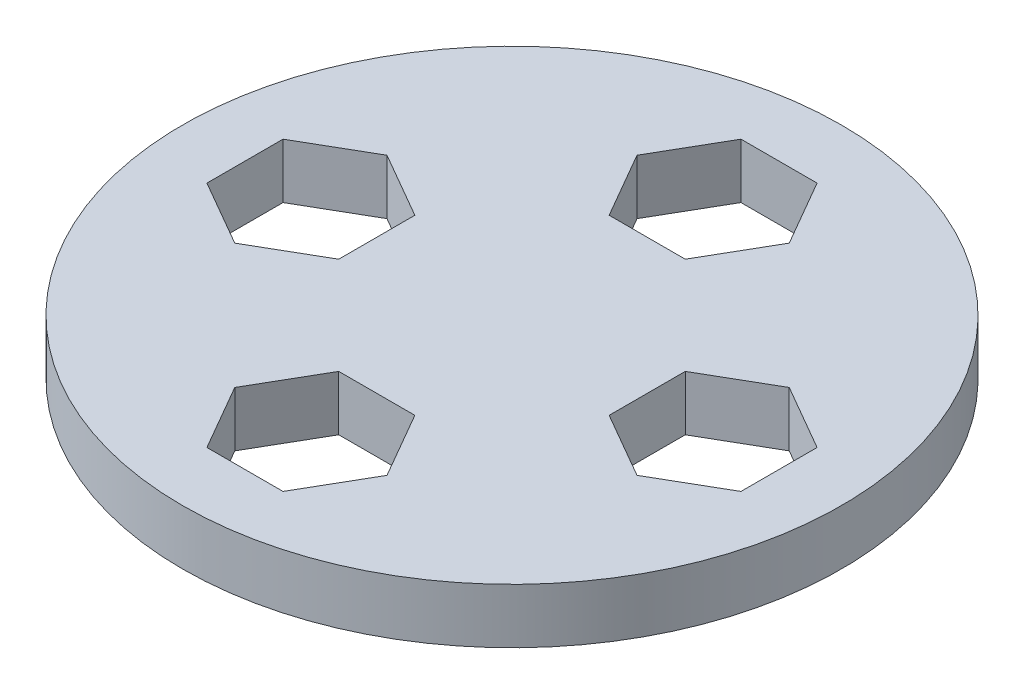
ISO-10303-21;
HEADER;
FILE_DESCRIPTION(('STEP AP214'),'2;1');
FILE_NAME('part.step','',(''),(''),'','','');
FILE_SCHEMA(('AUTOMOTIVE_DESIGN { 1 0 10303 214 1 1 1 1 }'));
ENDSEC;
DATA;
#1=APPLICATION_CONTEXT('core data for automotive mechanical design processes');
#2=APPLICATION_PROTOCOL_DEFINITION('international standard','automotive_design',2000,#1);
#3=PRODUCT_CONTEXT('',#1,'mechanical');
#4=PRODUCT('Part','Part','',(#3));
#5=PRODUCT_RELATED_PRODUCT_CATEGORY('part','',(#4));
#6=PRODUCT_DEFINITION_FORMATION('','',#4);
#7=PRODUCT_DEFINITION_CONTEXT('part definition',#1,'design');
#8=PRODUCT_DEFINITION('design','',#6,#7);
#9=PRODUCT_DEFINITION_SHAPE('','',#8);
#10=(LENGTH_UNIT() NAMED_UNIT(*) SI_UNIT(.MILLI.,.METRE.));
#11=(NAMED_UNIT(*) PLANE_ANGLE_UNIT() SI_UNIT($,.RADIAN.));
#12=(NAMED_UNIT(*) SI_UNIT($,.STERADIAN.) SOLID_ANGLE_UNIT());
#13=UNCERTAINTY_MEASURE_WITH_UNIT(LENGTH_MEASURE(1.E-05),#10,'distance_accuracy_value','');
#14=(GEOMETRIC_REPRESENTATION_CONTEXT(3) GLOBAL_UNCERTAINTY_ASSIGNED_CONTEXT((#13)) GLOBAL_UNIT_ASSIGNED_CONTEXT((#10,
#11,#12)) REPRESENTATION_CONTEXT('',''));
#15=CARTESIAN_POINT('',(0.,0.,0.));
#16=DIRECTION('',(0.,0.,1.));
#17=DIRECTION('',(1.,0.,0.));
#18=AXIS2_PLACEMENT_3D('',#15,#16,#17);
#19=CARTESIAN_POINT('',(0.,8.5,0.));
#20=DIRECTION('',(0.,-1.,0.));
#21=DIRECTION('',(0.,0.,-1.));
#22=AXIS2_PLACEMENT_3D('',#19,#20,#21);
#23=CYLINDRICAL_SURFACE('',#22,15.);
#24=CARTESIAN_POINT('',(0.,8.5,0.));
#25=DIRECTION('',(0.,1.,0.));
#26=DIRECTION('',(0.,0.,1.));
#27=AXIS2_PLACEMENT_3D('',#24,#25,#26);
#28=CIRCLE('',#27,15.);
#29=CARTESIAN_POINT('',(0.,8.5,15.));
#30=VERTEX_POINT('',#29);
#31=EDGE_CURVE('E372',#30,#30,#28,.T.);
#32=ORIENTED_EDGE('',*,*,#31,.F.);
#33=EDGE_LOOP('',(#32));
#34=FACE_BOUND('',#33,.T.);
#35=CARTESIAN_POINT('',(0.,6.,0.));
#36=DIRECTION('',(0.,1.,0.));
#37=DIRECTION('',(0.,0.,1.));
#38=AXIS2_PLACEMENT_3D('',#35,#36,#37);
#39=CIRCLE('',#38,15.);
#40=CARTESIAN_POINT('',(0.,6.,15.));
#41=VERTEX_POINT('',#40);
#42=EDGE_CURVE('E361',#41,#41,#39,.T.);
#43=ORIENTED_EDGE('',*,*,#42,.T.);
#44=EDGE_LOOP('',(#43));
#45=FACE_BOUND('',#44,.T.);
#46=ADVANCED_FACE('F33',(#34,#45),#23,.T.);
#47=CARTESIAN_POINT('',(0.,8.5,0.));
#48=DIRECTION('',(0.,1.,0.));
#49=DIRECTION('',(0.,0.,1.));
#50=AXIS2_PLACEMENT_3D('',#47,#48,#49);
#51=PLANE('',#50);
#52=DIRECTION('',(-0.866025403784444,0.,0.499999999999991));
#53=VECTOR('',#52,1.);
#54=CARTESIAN_POINT('',(-9.15400145941037,8.5,-3.46410161513785));
#55=LINE('',#54,#53);
#56=CARTESIAN_POINT('',(-9.15400145941037,8.5,-3.46410161513785));
#57=VERTEX_POINT('',#56);
#58=CARTESIAN_POINT('',(-12.1540014594104,8.5,-1.732050807569));
#59=VERTEX_POINT('',#58);
#60=EDGE_CURVE('E47',#57,#59,#55,.T.);
#61=ORIENTED_EDGE('',*,*,#60,.F.);
#62=DIRECTION('',(-0.866025403784433,0.,-0.500000000000009));
#63=VECTOR('',#62,1.);
#64=CARTESIAN_POINT('',(-6.15400145941038,8.5,-1.73205080756894));
#65=LINE('',#64,#63);
#66=CARTESIAN_POINT('',(-6.15400145941038,8.5,-1.73205080756894));
#67=VERTEX_POINT('',#66);
#68=EDGE_CURVE('E230',#67,#57,#65,.T.);
#69=ORIENTED_EDGE('',*,*,#68,.F.);
#70=DIRECTION('',(0.,0.,-1.));
#71=VECTOR('',#70,1.);
#72=CARTESIAN_POINT('',(-6.15400145941042,8.5,1.73205080756882));
#73=LINE('',#72,#71);
#74=CARTESIAN_POINT('',(-6.15400145941042,8.5,1.73205080756882));
#75=VERTEX_POINT('',#74);
#76=EDGE_CURVE('E228',#75,#67,#73,.T.);
#77=ORIENTED_EDGE('',*,*,#76,.F.);
#78=DIRECTION('',(0.866025403784444,0.,-0.499999999999991));
#79=VECTOR('',#78,1.);
#80=CARTESIAN_POINT('',(-9.15400145941044,8.5,3.46410161513766));
#81=LINE('',#80,#79);
#82=CARTESIAN_POINT('',(-9.15400145941044,8.5,3.46410161513766));
#83=VERTEX_POINT('',#82);
#84=EDGE_CURVE('E206',#83,#75,#81,.T.);
#85=ORIENTED_EDGE('',*,*,#84,.F.);
#86=DIRECTION('',(0.866025403784433,0.,0.500000000000009));
#87=VECTOR('',#86,1.);
#88=CARTESIAN_POINT('',(-12.1540014594104,8.5,1.73205080756875));
#89=LINE('',#88,#87);
#90=CARTESIAN_POINT('',(-12.1540014594104,8.5,1.73205080756875));
#91=VERTEX_POINT('',#90);
#92=EDGE_CURVE('E224',#91,#83,#89,.T.);
#93=ORIENTED_EDGE('',*,*,#92,.F.);
#94=DIRECTION('',(0.,0.,1.));
#95=VECTOR('',#94,1.);
#96=CARTESIAN_POINT('',(-12.1540014594104,8.5,-1.732050807569));
#97=LINE('',#96,#95);
#98=EDGE_CURVE('E221',#59,#91,#97,.T.);
#99=ORIENTED_EDGE('',*,*,#98,.F.);
#100=EDGE_LOOP('',(#61,#69,#77,#85,#93,#99));
#101=FACE_BOUND('',#100,.T.);
#102=DIRECTION('',(0.499999999999994,0.,0.866025403784442));
#103=VECTOR('',#102,1.);
#104=CARTESIAN_POINT('',(-3.46410161513782,8.5,9.15400145941038));
#105=LINE('',#104,#103);
#106=CARTESIAN_POINT('',(-3.46410161513782,8.5,9.15400145941038));
#107=VERTEX_POINT('',#106);
#108=CARTESIAN_POINT('',(-1.73205080756896,8.5,12.1540014594104));
#109=VERTEX_POINT('',#108);
#110=EDGE_CURVE('E236',#107,#109,#105,.T.);
#111=ORIENTED_EDGE('',*,*,#110,.F.);
#112=DIRECTION('',(-0.500000000000006,0.,0.866025403784435));
#113=VECTOR('',#112,1.);
#114=CARTESIAN_POINT('',(-1.73205080756892,8.5,6.15400145941039));
#115=LINE('',#114,#113);
#116=CARTESIAN_POINT('',(-1.73205080756892,8.5,6.15400145941039));
#117=VERTEX_POINT('',#116);
#118=EDGE_CURVE('E244',#117,#107,#115,.T.);
#119=ORIENTED_EDGE('',*,*,#118,.F.);
#120=DIRECTION('',(-1.,0.,0.));
#121=VECTOR('',#120,1.);
#122=CARTESIAN_POINT('',(1.73205080756884,8.5,6.15400145941042));
#123=LINE('',#122,#121);
#124=CARTESIAN_POINT('',(1.73205080756884,8.5,6.15400145941042));
#125=VERTEX_POINT('',#124);
#126=EDGE_CURVE('E266',#125,#117,#123,.T.);
#127=ORIENTED_EDGE('',*,*,#126,.F.);
#128=DIRECTION('',(-0.499999999999994,0.,-0.866025403784442));
#129=VECTOR('',#128,1.);
#130=CARTESIAN_POINT('',(3.46410161513769,8.5,9.15400145941043));
#131=LINE('',#130,#129);
#132=CARTESIAN_POINT('',(3.46410161513769,8.5,9.15400145941043));
#133=VERTEX_POINT('',#132);
#134=EDGE_CURVE('E263',#133,#125,#131,.T.);
#135=ORIENTED_EDGE('',*,*,#134,.F.);
#136=DIRECTION('',(0.500000000000006,0.,-0.866025403784435));
#137=VECTOR('',#136,1.);
#138=CARTESIAN_POINT('',(1.73205080756879,8.5,12.1540014594104));
#139=LINE('',#138,#137);
#140=CARTESIAN_POINT('',(1.73205080756879,8.5,12.1540014594104));
#141=VERTEX_POINT('',#140);
#142=EDGE_CURVE('E260',#141,#133,#139,.T.);
#143=ORIENTED_EDGE('',*,*,#142,.F.);
#144=DIRECTION('',(1.,0.,0.));
#145=VECTOR('',#144,1.);
#146=CARTESIAN_POINT('',(-1.73205080756896,8.5,12.1540014594104));
#147=LINE('',#146,#145);
#148=EDGE_CURVE('E257',#109,#141,#147,.T.);
#149=ORIENTED_EDGE('',*,*,#148,.F.);
#150=EDGE_LOOP('',(#111,#119,#127,#135,#143,#149));
#151=FACE_BOUND('',#150,.T.);
#152=DIRECTION('',(0.86602540378444,0.,-0.499999999999997));
#153=VECTOR('',#152,1.);
#154=CARTESIAN_POINT('',(9.15400145941039,8.5,3.46410161513778));
#155=LINE('',#154,#153);
#156=CARTESIAN_POINT('',(9.15400145941039,8.5,3.46410161513778));
#157=VERTEX_POINT('',#156);
#158=CARTESIAN_POINT('',(12.1540014594104,8.5,1.73205080756892));
#159=VERTEX_POINT('',#158);
#160=EDGE_CURVE('E273',#157,#159,#155,.T.);
#161=ORIENTED_EDGE('',*,*,#160,.F.);
#162=DIRECTION('',(0.866025403784437,0.,0.500000000000003));
#163=VECTOR('',#162,1.);
#164=CARTESIAN_POINT('',(6.1540014594104,8.5,1.7320508075689));
#165=LINE('',#164,#163);
#166=CARTESIAN_POINT('',(6.1540014594104,8.5,1.7320508075689));
#167=VERTEX_POINT('',#166);
#168=EDGE_CURVE('E288',#167,#157,#165,.T.);
#169=ORIENTED_EDGE('',*,*,#168,.F.);
#170=DIRECTION('',(0.,0.,1.));
#171=VECTOR('',#170,1.);
#172=CARTESIAN_POINT('',(6.15400145941041,8.5,-1.73205080756886));
#173=LINE('',#172,#171);
#174=CARTESIAN_POINT('',(6.15400145941041,8.5,-1.73205080756886));
#175=VERTEX_POINT('',#174);
#176=EDGE_CURVE('E310',#175,#167,#173,.T.);
#177=ORIENTED_EDGE('',*,*,#176,.F.);
#178=DIRECTION('',(-0.86602540378444,0.,0.499999999999997));
#179=VECTOR('',#178,1.);
#180=CARTESIAN_POINT('',(9.15400145941041,8.5,-3.46410161513773));
#181=LINE('',#180,#179);
#182=CARTESIAN_POINT('',(9.15400145941041,8.5,-3.46410161513773));
#183=VERTEX_POINT('',#182);
#184=EDGE_CURVE('E307',#183,#175,#181,.T.);
#185=ORIENTED_EDGE('',*,*,#184,.F.);
#186=DIRECTION('',(-0.866025403784437,0.,-0.500000000000003));
#187=VECTOR('',#186,1.);
#188=CARTESIAN_POINT('',(12.1540014594104,8.5,-1.73205080756884));
#189=LINE('',#188,#187);
#190=CARTESIAN_POINT('',(12.1540014594104,8.5,-1.73205080756884));
#191=VERTEX_POINT('',#190);
#192=EDGE_CURVE('E304',#191,#183,#189,.T.);
#193=ORIENTED_EDGE('',*,*,#192,.F.);
#194=DIRECTION('',(0.,0.,-1.));
#195=VECTOR('',#194,1.);
#196=CARTESIAN_POINT('',(12.1540014594104,8.5,1.73205080756892));
#197=LINE('',#196,#195);
#198=EDGE_CURVE('E301',#159,#191,#197,.T.);
#199=ORIENTED_EDGE('',*,*,#198,.F.);
#200=EDGE_LOOP('',(#161,#169,#177,#185,#193,#199));
#201=FACE_BOUND('',#200,.T.);
#202=DIRECTION('',(0.5,0.,-0.866025403784438));
#203=VECTOR('',#202,1.);
#204=CARTESIAN_POINT('',(1.73205080756888,8.5,-6.1540014594104));
#205=LINE('',#204,#203);
#206=CARTESIAN_POINT('',(1.73205080756888,8.5,-6.1540014594104));
#207=VERTEX_POINT('',#206);
#208=CARTESIAN_POINT('',(3.46410161513775,8.5,-9.1540014594104));
#209=VERTEX_POINT('',#208);
#210=EDGE_CURVE('E317',#207,#209,#205,.T.);
#211=ORIENTED_EDGE('',*,*,#210,.F.);
#212=DIRECTION('',(1.,0.,0.));
#213=VECTOR('',#212,1.);
#214=CARTESIAN_POINT('',(-1.73205080756888,8.5,-6.1540014594104));
#215=LINE('',#214,#213);
#216=CARTESIAN_POINT('',(-1.73205080756888,8.5,-6.1540014594104));
#217=VERTEX_POINT('',#216);
#218=EDGE_CURVE('E332',#217,#207,#215,.T.);
#219=ORIENTED_EDGE('',*,*,#218,.F.);
#220=DIRECTION('',(0.5,0.,0.866025403784439));
#221=VECTOR('',#220,1.);
#222=CARTESIAN_POINT('',(-3.46410161513776,8.5,-9.1540014594104));
#223=LINE('',#222,#221);
#224=CARTESIAN_POINT('',(-3.46410161513776,8.5,-9.1540014594104));
#225=VERTEX_POINT('',#224);
#226=EDGE_CURVE('E354',#225,#217,#223,.T.);
#227=ORIENTED_EDGE('',*,*,#226,.F.);
#228=DIRECTION('',(-0.5,0.,0.866025403784439));
#229=VECTOR('',#228,1.);
#230=CARTESIAN_POINT('',(-1.73205080756888,8.5,-12.1540014594104));
#231=LINE('',#230,#229);
#232=CARTESIAN_POINT('',(-1.73205080756888,8.5,-12.1540014594104));
#233=VERTEX_POINT('',#232);
#234=EDGE_CURVE('E351',#233,#225,#231,.T.);
#235=ORIENTED_EDGE('',*,*,#234,.F.);
#236=DIRECTION('',(-1.,0.,0.));
#237=VECTOR('',#236,1.);
#238=CARTESIAN_POINT('',(1.73205080756888,8.5,-12.1540014594104));
#239=LINE('',#238,#237);
#240=CARTESIAN_POINT('',(1.73205080756888,8.5,-12.1540014594104));
#241=VERTEX_POINT('',#240);
#242=EDGE_CURVE('E348',#241,#233,#239,.T.);
#243=ORIENTED_EDGE('',*,*,#242,.F.);
#244=DIRECTION('',(-0.5,0.,-0.866025403784439));
#245=VECTOR('',#244,1.);
#246=CARTESIAN_POINT('',(3.46410161513775,8.5,-9.1540014594104));
#247=LINE('',#246,#245);
#248=EDGE_CURVE('E345',#209,#241,#247,.T.);
#249=ORIENTED_EDGE('',*,*,#248,.F.);
#250=EDGE_LOOP('',(#211,#219,#227,#235,#243,#249));
#251=FACE_BOUND('',#250,.T.);
#252=ORIENTED_EDGE('',*,*,#31,.T.);
#253=EDGE_LOOP('',(#252));
#254=FACE_BOUND('',#253,.T.);
#255=ADVANCED_FACE('F408',(#101,#151,#201,#251,#254),#51,.T.);
#256=CARTESIAN_POINT('',(0.,6.,0.));
#257=DIRECTION('',(0.,1.,0.));
#258=DIRECTION('',(0.,0.,1.));
#259=AXIS2_PLACEMENT_3D('',#256,#257,#258);
#260=PLANE('',#259);
#261=DIRECTION('',(1.,0.,0.));
#262=VECTOR('',#261,1.);
#263=CARTESIAN_POINT('',(-1.73205080756888,6.,-6.1540014594104));
#264=LINE('',#263,#262);
#265=CARTESIAN_POINT('',(-1.73205080756888,6.,-6.1540014594104));
#266=VERTEX_POINT('',#265);
#267=CARTESIAN_POINT('',(1.73205080756888,6.,-6.1540014594104));
#268=VERTEX_POINT('',#267);
#269=EDGE_CURVE('E340',#266,#268,#264,.T.);
#270=ORIENTED_EDGE('',*,*,#269,.T.);
#271=DIRECTION('',(0.5,0.,-0.866025403784439));
#272=VECTOR('',#271,1.);
#273=CARTESIAN_POINT('',(-1.3657226937113,6.,-0.788500364852602));
#274=LINE('',#273,#272);
#275=CARTESIAN_POINT('',(3.46410161513775,6.,-9.1540014594104));
#276=VERTEX_POINT('',#275);
#277=EDGE_CURVE('E375',#268,#276,#274,.T.);
#278=ORIENTED_EDGE('',*,*,#277,.T.);
#279=DIRECTION('',(-0.5,0.,-0.866025403784439));
#280=VECTOR('',#279,1.);
#281=CARTESIAN_POINT('',(3.46410161513775,6.,-9.1540014594104));
#282=LINE('',#281,#280);
#283=CARTESIAN_POINT('',(1.73205080756888,6.,-12.1540014594104));
#284=VERTEX_POINT('',#283);
#285=EDGE_CURVE('E328',#276,#284,#282,.T.);
#286=ORIENTED_EDGE('',*,*,#285,.T.);
#287=DIRECTION('',(-1.,0.,0.));
#288=VECTOR('',#287,1.);
#289=CARTESIAN_POINT('',(1.73205080756888,6.,-12.1540014594104));
#290=LINE('',#289,#288);
#291=CARTESIAN_POINT('',(-1.73205080756888,6.,-12.1540014594104));
#292=VERTEX_POINT('',#291);
#293=EDGE_CURVE('E331',#284,#292,#290,.T.);
#294=ORIENTED_EDGE('',*,*,#293,.T.);
#295=DIRECTION('',(-0.5,0.,0.866025403784439));
#296=VECTOR('',#295,1.);
#297=CARTESIAN_POINT('',(-1.73205080756888,6.,-12.1540014594104));
#298=LINE('',#297,#296);
#299=CARTESIAN_POINT('',(-3.46410161513776,6.,-9.1540014594104));
#300=VERTEX_POINT('',#299);
#301=EDGE_CURVE('E335',#292,#300,#298,.T.);
#302=ORIENTED_EDGE('',*,*,#301,.T.);
#303=DIRECTION('',(0.5,0.,0.866025403784439));
#304=VECTOR('',#303,1.);
#305=CARTESIAN_POINT('',(-3.46410161513776,6.,-9.1540014594104));
#306=LINE('',#305,#304);
#307=EDGE_CURVE('E338',#300,#266,#306,.T.);
#308=ORIENTED_EDGE('',*,*,#307,.T.);
#309=EDGE_LOOP('',(#270,#278,#286,#294,#302,#308));
#310=FACE_BOUND('',#309,.T.);
#311=DIRECTION('',(0.,0.,1.));
#312=VECTOR('',#311,1.);
#313=CARTESIAN_POINT('',(6.15400145941041,6.,-1.73205080756886));
#314=LINE('',#313,#312);
#315=CARTESIAN_POINT('',(6.15400145941041,6.,-1.73205080756886));
#316=VERTEX_POINT('',#315);
#317=CARTESIAN_POINT('',(6.1540014594104,6.,1.7320508075689));
#318=VERTEX_POINT('',#317);
#319=EDGE_CURVE('E296',#316,#318,#314,.T.);
#320=ORIENTED_EDGE('',*,*,#319,.T.);
#321=DIRECTION('',(0.866025403784437,0.,0.500000000000003));
#322=VECTOR('',#321,1.);
#323=CARTESIAN_POINT('',(0.788500364852608,6.,-1.3657226937113));
#324=LINE('',#323,#322);
#325=CARTESIAN_POINT('',(9.15400145941039,6.,3.46410161513778));
#326=VERTEX_POINT('',#325);
#327=EDGE_CURVE('E379',#318,#326,#324,.T.);
#328=ORIENTED_EDGE('',*,*,#327,.T.);
#329=DIRECTION('',(0.86602540378444,0.,-0.499999999999997));
#330=VECTOR('',#329,1.);
#331=CARTESIAN_POINT('',(9.15400145941039,6.,3.46410161513778));
#332=LINE('',#331,#330);
#333=CARTESIAN_POINT('',(12.1540014594104,6.,1.73205080756892));
#334=VERTEX_POINT('',#333);
#335=EDGE_CURVE('E284',#326,#334,#332,.T.);
#336=ORIENTED_EDGE('',*,*,#335,.T.);
#337=DIRECTION('',(0.,0.,-1.));
#338=VECTOR('',#337,1.);
#339=CARTESIAN_POINT('',(12.1540014594104,6.,1.73205080756892));
#340=LINE('',#339,#338);
#341=CARTESIAN_POINT('',(12.1540014594104,6.,-1.73205080756884));
#342=VERTEX_POINT('',#341);
#343=EDGE_CURVE('E287',#334,#342,#340,.T.);
#344=ORIENTED_EDGE('',*,*,#343,.T.);
#345=DIRECTION('',(-0.866025403784437,0.,-0.500000000000003));
#346=VECTOR('',#345,1.);
#347=CARTESIAN_POINT('',(12.1540014594104,6.,-1.73205080756884));
#348=LINE('',#347,#346);
#349=CARTESIAN_POINT('',(9.15400145941041,6.,-3.46410161513773));
#350=VERTEX_POINT('',#349);
#351=EDGE_CURVE('E291',#342,#350,#348,.T.);
#352=ORIENTED_EDGE('',*,*,#351,.T.);
#353=DIRECTION('',(-0.86602540378444,0.,0.499999999999997));
#354=VECTOR('',#353,1.);
#355=CARTESIAN_POINT('',(9.15400145941041,6.,-3.46410161513773));
#356=LINE('',#355,#354);
#357=EDGE_CURVE('E294',#350,#316,#356,.T.);
#358=ORIENTED_EDGE('',*,*,#357,.T.);
#359=EDGE_LOOP('',(#320,#328,#336,#344,#352,#358));
#360=FACE_BOUND('',#359,.T.);
#361=DIRECTION('',(-1.,0.,0.));
#362=VECTOR('',#361,1.);
#363=CARTESIAN_POINT('',(1.73205080756884,6.,6.15400145941042));
#364=LINE('',#363,#362);
#365=CARTESIAN_POINT('',(1.73205080756884,6.,6.15400145941042));
#366=VERTEX_POINT('',#365);
#367=CARTESIAN_POINT('',(-1.73205080756892,6.,6.15400145941039));
#368=VERTEX_POINT('',#367);
#369=EDGE_CURVE('E252',#366,#368,#364,.T.);
#370=ORIENTED_EDGE('',*,*,#369,.T.);
#371=DIRECTION('',(-0.500000000000006,0.,0.866025403784435));
#372=VECTOR('',#371,1.);
#373=CARTESIAN_POINT('',(1.3657226937113,6.,0.788500364852611));
#374=LINE('',#373,#372);
#375=CARTESIAN_POINT('',(-3.46410161513782,6.,9.15400145941038));
#376=VERTEX_POINT('',#375);
#377=EDGE_CURVE('E40',#368,#376,#374,.T.);
#378=ORIENTED_EDGE('',*,*,#377,.T.);
#379=DIRECTION('',(0.499999999999994,0.,0.866025403784442));
#380=VECTOR('',#379,1.);
#381=CARTESIAN_POINT('',(-3.46410161513782,6.,9.15400145941038));
#382=LINE('',#381,#380);
#383=CARTESIAN_POINT('',(-1.73205080756896,6.,12.1540014594104));
#384=VERTEX_POINT('',#383);
#385=EDGE_CURVE('E240',#376,#384,#382,.T.);
#386=ORIENTED_EDGE('',*,*,#385,.T.);
#387=DIRECTION('',(1.,0.,0.));
#388=VECTOR('',#387,1.);
#389=CARTESIAN_POINT('',(-1.73205080756896,6.,12.1540014594104));
#390=LINE('',#389,#388);
#391=CARTESIAN_POINT('',(1.73205080756879,6.,12.1540014594104));
#392=VERTEX_POINT('',#391);
#393=EDGE_CURVE('E243',#384,#392,#390,.T.);
#394=ORIENTED_EDGE('',*,*,#393,.T.);
#395=DIRECTION('',(0.500000000000006,0.,-0.866025403784435));
#396=VECTOR('',#395,1.);
#397=CARTESIAN_POINT('',(1.73205080756879,6.,12.1540014594104));
#398=LINE('',#397,#396);
#399=CARTESIAN_POINT('',(3.46410161513769,6.,9.15400145941043));
#400=VERTEX_POINT('',#399);
#401=EDGE_CURVE('E247',#392,#400,#398,.T.);
#402=ORIENTED_EDGE('',*,*,#401,.T.);
#403=DIRECTION('',(-0.499999999999994,0.,-0.866025403784442));
#404=VECTOR('',#403,1.);
#405=CARTESIAN_POINT('',(3.46410161513769,6.,9.15400145941043));
#406=LINE('',#405,#404);
#407=EDGE_CURVE('E250',#400,#366,#406,.T.);
#408=ORIENTED_EDGE('',*,*,#407,.T.);
#409=EDGE_LOOP('',(#370,#378,#386,#394,#402,#408));
#410=FACE_BOUND('',#409,.T.);
#411=DIRECTION('',(0.866025403784444,0.,-0.499999999999991));
#412=VECTOR('',#411,1.);
#413=CARTESIAN_POINT('',(-9.15400145941044,6.,3.46410161513766));
#414=LINE('',#413,#412);
#415=CARTESIAN_POINT('',(-9.15400145941044,6.,3.46410161513766));
#416=VERTEX_POINT('',#415);
#417=CARTESIAN_POINT('',(-6.15400145941042,6.,1.73205080756882));
#418=VERTEX_POINT('',#417);
#419=EDGE_CURVE('E192',#416,#418,#414,.T.);
#420=ORIENTED_EDGE('',*,*,#419,.T.);
#421=DIRECTION('',(0.,0.,-1.));
#422=VECTOR('',#421,1.);
#423=CARTESIAN_POINT('',(-6.15400145941042,6.,1.73205080756882));
#424=LINE('',#423,#422);
#425=CARTESIAN_POINT('',(-6.15400145941038,6.,-1.73205080756894));
#426=VERTEX_POINT('',#425);
#427=EDGE_CURVE('E197',#418,#426,#424,.T.);
#428=ORIENTED_EDGE('',*,*,#427,.T.);
#429=DIRECTION('',(-0.866025403784433,0.,-0.500000000000009));
#430=VECTOR('',#429,1.);
#431=CARTESIAN_POINT('',(-0.788500364852616,6.,1.36572269371129));
#432=LINE('',#431,#430);
#433=CARTESIAN_POINT('',(-9.15400145941037,6.,-3.46410161513785));
#434=VERTEX_POINT('',#433);
#435=EDGE_CURVE('E11',#426,#434,#432,.T.);
#436=ORIENTED_EDGE('',*,*,#435,.T.);
#437=DIRECTION('',(-0.866025403784444,0.,0.499999999999991));
#438=VECTOR('',#437,1.);
#439=CARTESIAN_POINT('',(-9.15400145941037,6.,-3.46410161513785));
#440=LINE('',#439,#438);
#441=CARTESIAN_POINT('',(-12.1540014594104,6.,-1.732050807569));
#442=VERTEX_POINT('',#441);
#443=EDGE_CURVE('E233',#434,#442,#440,.T.);
#444=ORIENTED_EDGE('',*,*,#443,.T.);
#445=DIRECTION('',(0.,0.,1.));
#446=VECTOR('',#445,1.);
#447=CARTESIAN_POINT('',(-12.1540014594104,6.,-1.732050807569));
#448=LINE('',#447,#446);
#449=CARTESIAN_POINT('',(-12.1540014594104,6.,1.73205080756875));
#450=VERTEX_POINT('',#449);
#451=EDGE_CURVE('E517',#442,#450,#448,.T.);
#452=ORIENTED_EDGE('',*,*,#451,.T.);
#453=DIRECTION('',(0.866025403784433,0.,0.500000000000009));
#454=VECTOR('',#453,1.);
#455=CARTESIAN_POINT('',(-12.1540014594104,6.,1.73205080756875));
#456=LINE('',#455,#454);
#457=EDGE_CURVE('E55',#450,#416,#456,.T.);
#458=ORIENTED_EDGE('',*,*,#457,.T.);
#459=EDGE_LOOP('',(#420,#428,#436,#444,#452,#458));
#460=FACE_BOUND('',#459,.T.);
#461=ORIENTED_EDGE('',*,*,#42,.F.);
#462=EDGE_LOOP('',(#461));
#463=FACE_BOUND('',#462,.T.);
#464=ADVANCED_FACE('F194',(#310,#360,#410,#460,#463),#260,.F.);
#465=CARTESIAN_POINT('',(1.73205080756888,6.,-6.1540014594104));
#466=DIRECTION('',(0.866025403784439,0.,0.5));
#467=DIRECTION('',(0.5,0.,-0.866025403784439));
#468=AXIS2_PLACEMENT_3D('',#465,#466,#467);
#469=PLANE('',#468);
#470=ORIENTED_EDGE('',*,*,#210,.T.);
#471=DIRECTION('',(0.,1.,0.));
#472=VECTOR('',#471,1.);
#473=CARTESIAN_POINT('',(3.46410161513775,6.,-9.1540014594104));
#474=LINE('',#473,#472);
#475=EDGE_CURVE('E343',#276,#209,#474,.T.);
#476=ORIENTED_EDGE('',*,*,#475,.F.);
#477=ORIENTED_EDGE('',*,*,#277,.F.);
#478=DIRECTION('',(0.,1.,0.));
#479=VECTOR('',#478,1.);
#480=CARTESIAN_POINT('',(1.73205080756888,6.,-6.1540014594104));
#481=LINE('',#480,#479);
#482=EDGE_CURVE('E359',#268,#207,#481,.T.);
#483=ORIENTED_EDGE('',*,*,#482,.T.);
#484=EDGE_LOOP('',(#470,#476,#477,#483));
#485=FACE_BOUND('',#484,.T.);
#486=ADVANCED_FACE('F427',(#485),#469,.F.);
#487=CARTESIAN_POINT('',(-1.73205080756888,6.,-6.1540014594104));
#488=DIRECTION('',(0.,0.,1.));
#489=DIRECTION('',(1.,0.,0.));
#490=AXIS2_PLACEMENT_3D('',#487,#488,#489);
#491=PLANE('',#490);
#492=ORIENTED_EDGE('',*,*,#218,.T.);
#493=ORIENTED_EDGE('',*,*,#482,.F.);
#494=ORIENTED_EDGE('',*,*,#269,.F.);
#495=DIRECTION('',(0.,1.,0.));
#496=VECTOR('',#495,1.);
#497=CARTESIAN_POINT('',(-1.73205080756888,6.,-6.1540014594104));
#498=LINE('',#497,#496);
#499=EDGE_CURVE('E362',#266,#217,#498,.T.);
#500=ORIENTED_EDGE('',*,*,#499,.T.);
#501=EDGE_LOOP('',(#492,#493,#494,#500));
#502=FACE_BOUND('',#501,.T.);
#503=ADVANCED_FACE('F433',(#502),#491,.F.);
#504=CARTESIAN_POINT('',(-3.46410161513776,6.,-9.1540014594104));
#505=DIRECTION('',(-0.866025403784439,0.,0.5));
#506=DIRECTION('',(0.5,0.,0.866025403784439));
#507=AXIS2_PLACEMENT_3D('',#504,#505,#506);
#508=PLANE('',#507);
#509=ORIENTED_EDGE('',*,*,#226,.T.);
#510=ORIENTED_EDGE('',*,*,#499,.F.);
#511=ORIENTED_EDGE('',*,*,#307,.F.);
#512=DIRECTION('',(0.,1.,0.));
#513=VECTOR('',#512,1.);
#514=CARTESIAN_POINT('',(-3.46410161513776,6.,-9.1540014594104));
#515=LINE('',#514,#513);
#516=EDGE_CURVE('E364',#300,#225,#515,.T.);
#517=ORIENTED_EDGE('',*,*,#516,.T.);
#518=EDGE_LOOP('',(#509,#510,#511,#517));
#519=FACE_BOUND('',#518,.T.);
#520=ADVANCED_FACE('F450',(#519),#508,.F.);
#521=CARTESIAN_POINT('',(-1.73205080756888,6.,-12.1540014594104));
#522=DIRECTION('',(-0.866025403784439,0.,-0.5));
#523=DIRECTION('',(-0.5,0.,0.866025403784439));
#524=AXIS2_PLACEMENT_3D('',#521,#522,#523);
#525=PLANE('',#524);
#526=ORIENTED_EDGE('',*,*,#234,.T.);
#527=ORIENTED_EDGE('',*,*,#516,.F.);
#528=ORIENTED_EDGE('',*,*,#301,.F.);
#529=DIRECTION('',(0.,1.,0.));
#530=VECTOR('',#529,1.);
#531=CARTESIAN_POINT('',(-1.73205080756888,6.,-12.1540014594104));
#532=LINE('',#531,#530);
#533=EDGE_CURVE('E366',#292,#233,#532,.T.);
#534=ORIENTED_EDGE('',*,*,#533,.T.);
#535=EDGE_LOOP('',(#526,#527,#528,#534));
#536=FACE_BOUND('',#535,.T.);
#537=ADVANCED_FACE('F446',(#536),#525,.F.);
#538=CARTESIAN_POINT('',(1.73205080756888,6.,-12.1540014594104));
#539=DIRECTION('',(0.,0.,-1.));
#540=DIRECTION('',(-1.,0.,0.));
#541=AXIS2_PLACEMENT_3D('',#538,#539,#540);
#542=PLANE('',#541);
#543=ORIENTED_EDGE('',*,*,#242,.T.);
#544=ORIENTED_EDGE('',*,*,#533,.F.);
#545=ORIENTED_EDGE('',*,*,#293,.F.);
#546=DIRECTION('',(0.,1.,0.));
#547=VECTOR('',#546,1.);
#548=CARTESIAN_POINT('',(1.73205080756888,6.,-12.1540014594104));
#549=LINE('',#548,#547);
#550=EDGE_CURVE('E368',#284,#241,#549,.T.);
#551=ORIENTED_EDGE('',*,*,#550,.T.);
#552=EDGE_LOOP('',(#543,#544,#545,#551));
#553=FACE_BOUND('',#552,.T.);
#554=ADVANCED_FACE('F442',(#553),#542,.F.);
#555=CARTESIAN_POINT('',(3.46410161513775,6.,-9.1540014594104));
#556=DIRECTION('',(0.866025403784439,0.,-0.5));
#557=DIRECTION('',(-0.5,0.,-0.866025403784439));
#558=AXIS2_PLACEMENT_3D('',#555,#556,#557);
#559=PLANE('',#558);
#560=ORIENTED_EDGE('',*,*,#248,.T.);
#561=ORIENTED_EDGE('',*,*,#550,.F.);
#562=ORIENTED_EDGE('',*,*,#285,.F.);
#563=ORIENTED_EDGE('',*,*,#475,.T.);
#564=EDGE_LOOP('',(#560,#561,#562,#563));
#565=FACE_BOUND('',#564,.T.);
#566=ADVANCED_FACE('F438',(#565),#559,.F.);
#567=CARTESIAN_POINT('',(9.15400145941039,6.,3.46410161513778));
#568=DIRECTION('',(0.499999999999997,0.,0.866025403784441));
#569=DIRECTION('',(0.866025403784441,0.,-0.499999999999997));
#570=AXIS2_PLACEMENT_3D('',#567,#568,#569);
#571=PLANE('',#570);
#572=ORIENTED_EDGE('',*,*,#160,.T.);
#573=DIRECTION('',(0.,1.,0.));
#574=VECTOR('',#573,1.);
#575=CARTESIAN_POINT('',(12.1540014594104,6.,1.73205080756892));
#576=LINE('',#575,#574);
#577=EDGE_CURVE('E299',#334,#159,#576,.T.);
#578=ORIENTED_EDGE('',*,*,#577,.F.);
#579=ORIENTED_EDGE('',*,*,#335,.F.);
#580=DIRECTION('',(0.,1.,0.));
#581=VECTOR('',#580,1.);
#582=CARTESIAN_POINT('',(9.15400145941039,6.,3.46410161513778));
#583=LINE('',#582,#581);
#584=EDGE_CURVE('E315',#326,#157,#583,.T.);
#585=ORIENTED_EDGE('',*,*,#584,.T.);
#586=EDGE_LOOP('',(#572,#578,#579,#585));
#587=FACE_BOUND('',#586,.T.);
#588=ADVANCED_FACE('F441',(#587),#571,.F.);
#589=CARTESIAN_POINT('',(6.1540014594104,6.,1.7320508075689));
#590=DIRECTION('',(-0.500000000000003,0.,0.866025403784437));
#591=DIRECTION('',(0.866025403784437,0.,0.500000000000003));
#592=AXIS2_PLACEMENT_3D('',#589,#590,#591);
#593=PLANE('',#592);
#594=ORIENTED_EDGE('',*,*,#168,.T.);
#595=ORIENTED_EDGE('',*,*,#584,.F.);
#596=ORIENTED_EDGE('',*,*,#327,.F.);
#597=DIRECTION('',(0.,1.,0.));
#598=VECTOR('',#597,1.);
#599=CARTESIAN_POINT('',(6.1540014594104,6.,1.7320508075689));
#600=LINE('',#599,#598);
#601=EDGE_CURVE('E318',#318,#167,#600,.T.);
#602=ORIENTED_EDGE('',*,*,#601,.T.);
#603=EDGE_LOOP('',(#594,#595,#596,#602));
#604=FACE_BOUND('',#603,.T.);
#605=ADVANCED_FACE('F460',(#604),#593,.F.);
#606=CARTESIAN_POINT('',(6.15400145941041,6.,-1.73205080756886));
#607=DIRECTION('',(-1.,0.,0.));
#608=DIRECTION('',(0.,0.,1.));
#609=AXIS2_PLACEMENT_3D('',#606,#607,#608);
#610=PLANE('',#609);
#611=ORIENTED_EDGE('',*,*,#176,.T.);
#612=ORIENTED_EDGE('',*,*,#601,.F.);
#613=ORIENTED_EDGE('',*,*,#319,.F.);
#614=DIRECTION('',(0.,1.,0.));
#615=VECTOR('',#614,1.);
#616=CARTESIAN_POINT('',(6.15400145941041,6.,-1.73205080756886));
#617=LINE('',#616,#615);
#618=EDGE_CURVE('E320',#316,#175,#617,.T.);
#619=ORIENTED_EDGE('',*,*,#618,.T.);
#620=EDGE_LOOP('',(#611,#612,#613,#619));
#621=FACE_BOUND('',#620,.T.);
#622=ADVANCED_FACE('F473',(#621),#610,.F.);
#623=CARTESIAN_POINT('',(9.15400145941041,6.,-3.46410161513773));
#624=DIRECTION('',(-0.499999999999997,0.,-0.86602540378444));
#625=DIRECTION('',(-0.86602540378444,0.,0.499999999999997));
#626=AXIS2_PLACEMENT_3D('',#623,#624,#625);
#627=PLANE('',#626);
#628=ORIENTED_EDGE('',*,*,#184,.T.);
#629=ORIENTED_EDGE('',*,*,#618,.F.);
#630=ORIENTED_EDGE('',*,*,#357,.F.);
#631=DIRECTION('',(0.,1.,0.));
#632=VECTOR('',#631,1.);
#633=CARTESIAN_POINT('',(9.15400145941041,6.,-3.46410161513773));
#634=LINE('',#633,#632);
#635=EDGE_CURVE('E322',#350,#183,#634,.T.);
#636=ORIENTED_EDGE('',*,*,#635,.T.);
#637=EDGE_LOOP('',(#628,#629,#630,#636));
#638=FACE_BOUND('',#637,.T.);
#639=ADVANCED_FACE('F469',(#638),#627,.F.);
#640=CARTESIAN_POINT('',(12.1540014594104,6.,-1.73205080756884));
#641=DIRECTION('',(0.500000000000003,0.,-0.866025403784437));
#642=DIRECTION('',(-0.866025403784437,0.,-0.500000000000003));
#643=AXIS2_PLACEMENT_3D('',#640,#641,#642);
#644=PLANE('',#643);
#645=ORIENTED_EDGE('',*,*,#192,.T.);
#646=ORIENTED_EDGE('',*,*,#635,.F.);
#647=ORIENTED_EDGE('',*,*,#351,.F.);
#648=DIRECTION('',(0.,1.,0.));
#649=VECTOR('',#648,1.);
#650=CARTESIAN_POINT('',(12.1540014594104,6.,-1.73205080756884));
#651=LINE('',#650,#649);
#652=EDGE_CURVE('E324',#342,#191,#651,.T.);
#653=ORIENTED_EDGE('',*,*,#652,.T.);
#654=EDGE_LOOP('',(#645,#646,#647,#653));
#655=FACE_BOUND('',#654,.T.);
#656=ADVANCED_FACE('F465',(#655),#644,.F.);
#657=CARTESIAN_POINT('',(12.1540014594104,6.,1.73205080756892));
#658=DIRECTION('',(1.,0.,0.));
#659=DIRECTION('',(0.,0.,-1.));
#660=AXIS2_PLACEMENT_3D('',#657,#658,#659);
#661=PLANE('',#660);
#662=ORIENTED_EDGE('',*,*,#198,.T.);
#663=ORIENTED_EDGE('',*,*,#652,.F.);
#664=ORIENTED_EDGE('',*,*,#343,.F.);
#665=ORIENTED_EDGE('',*,*,#577,.T.);
#666=EDGE_LOOP('',(#662,#663,#664,#665));
#667=FACE_BOUND('',#666,.T.);
#668=ADVANCED_FACE('F462',(#667),#661,.F.);
#669=CARTESIAN_POINT('',(-3.46410161513782,6.,9.15400145941038));
#670=DIRECTION('',(-0.866025403784442,0.,0.499999999999994));
#671=DIRECTION('',(0.499999999999994,0.,0.866025403784442));
#672=AXIS2_PLACEMENT_3D('',#669,#670,#671);
#673=PLANE('',#672);
#674=ORIENTED_EDGE('',*,*,#110,.T.);
#675=DIRECTION('',(0.,1.,0.));
#676=VECTOR('',#675,1.);
#677=CARTESIAN_POINT('',(-1.73205080756896,6.,12.1540014594104));
#678=LINE('',#677,#676);
#679=EDGE_CURVE('E255',#384,#109,#678,.T.);
#680=ORIENTED_EDGE('',*,*,#679,.F.);
#681=ORIENTED_EDGE('',*,*,#385,.F.);
#682=DIRECTION('',(0.,1.,0.));
#683=VECTOR('',#682,1.);
#684=CARTESIAN_POINT('',(-3.46410161513782,6.,9.15400145941038));
#685=LINE('',#684,#683);
#686=EDGE_CURVE('E271',#376,#107,#685,.T.);
#687=ORIENTED_EDGE('',*,*,#686,.T.);
#688=EDGE_LOOP('',(#674,#680,#681,#687));
#689=FACE_BOUND('',#688,.T.);
#690=ADVANCED_FACE('F390',(#689),#673,.F.);
#691=CARTESIAN_POINT('',(-1.73205080756892,6.,6.15400145941039));
#692=DIRECTION('',(-0.866025403784435,0.,-0.500000000000006));
#693=DIRECTION('',(-0.500000000000006,0.,0.866025403784435));
#694=AXIS2_PLACEMENT_3D('',#691,#692,#693);
#695=PLANE('',#694);
#696=ORIENTED_EDGE('',*,*,#118,.T.);
#697=ORIENTED_EDGE('',*,*,#686,.F.);
#698=ORIENTED_EDGE('',*,*,#377,.F.);
#699=DIRECTION('',(0.,1.,0.));
#700=VECTOR('',#699,1.);
#701=CARTESIAN_POINT('',(-1.73205080756892,6.,6.15400145941039));
#702=LINE('',#701,#700);
#703=EDGE_CURVE('E274',#368,#117,#702,.T.);
#704=ORIENTED_EDGE('',*,*,#703,.T.);
#705=EDGE_LOOP('',(#696,#697,#698,#704));
#706=FACE_BOUND('',#705,.T.);
#707=ADVANCED_FACE('F386',(#706),#695,.F.);
#708=CARTESIAN_POINT('',(1.73205080756884,6.,6.15400145941042));
#709=DIRECTION('',(0.,0.,-1.));
#710=DIRECTION('',(-1.,0.,0.));
#711=AXIS2_PLACEMENT_3D('',#708,#709,#710);
#712=PLANE('',#711);
#713=ORIENTED_EDGE('',*,*,#126,.T.);
#714=ORIENTED_EDGE('',*,*,#703,.F.);
#715=ORIENTED_EDGE('',*,*,#369,.F.);
#716=DIRECTION('',(0.,1.,0.));
#717=VECTOR('',#716,1.);
#718=CARTESIAN_POINT('',(1.73205080756884,6.,6.15400145941042));
#719=LINE('',#718,#717);
#720=EDGE_CURVE('E276',#366,#125,#719,.T.);
#721=ORIENTED_EDGE('',*,*,#720,.T.);
#722=EDGE_LOOP('',(#713,#714,#715,#721));
#723=FACE_BOUND('',#722,.T.);
#724=ADVANCED_FACE('F406',(#723),#712,.F.);
#725=CARTESIAN_POINT('',(3.46410161513769,6.,9.15400145941043));
#726=DIRECTION('',(0.866025403784442,0.,-0.499999999999994));
#727=DIRECTION('',(-0.499999999999994,0.,-0.866025403784442));
#728=AXIS2_PLACEMENT_3D('',#725,#726,#727);
#729=PLANE('',#728);
#730=ORIENTED_EDGE('',*,*,#134,.T.);
#731=ORIENTED_EDGE('',*,*,#720,.F.);
#732=ORIENTED_EDGE('',*,*,#407,.F.);
#733=DIRECTION('',(0.,1.,0.));
#734=VECTOR('',#733,1.);
#735=CARTESIAN_POINT('',(3.46410161513769,6.,9.15400145941043));
#736=LINE('',#735,#734);
#737=EDGE_CURVE('E278',#400,#133,#736,.T.);
#738=ORIENTED_EDGE('',*,*,#737,.T.);
#739=EDGE_LOOP('',(#730,#731,#732,#738));
#740=FACE_BOUND('',#739,.T.);
#741=ADVANCED_FACE('F403',(#740),#729,.F.);
#742=CARTESIAN_POINT('',(1.73205080756879,6.,12.1540014594104));
#743=DIRECTION('',(0.866025403784435,0.,0.500000000000006));
#744=DIRECTION('',(0.500000000000006,0.,-0.866025403784435));
#745=AXIS2_PLACEMENT_3D('',#742,#743,#744);
#746=PLANE('',#745);
#747=ORIENTED_EDGE('',*,*,#142,.T.);
#748=ORIENTED_EDGE('',*,*,#737,.F.);
#749=ORIENTED_EDGE('',*,*,#401,.F.);
#750=DIRECTION('',(0.,1.,0.));
#751=VECTOR('',#750,1.);
#752=CARTESIAN_POINT('',(1.73205080756879,6.,12.1540014594104));
#753=LINE('',#752,#751);
#754=EDGE_CURVE('E280',#392,#141,#753,.T.);
#755=ORIENTED_EDGE('',*,*,#754,.T.);
#756=EDGE_LOOP('',(#747,#748,#749,#755));
#757=FACE_BOUND('',#756,.T.);
#758=ADVANCED_FACE('F399',(#757),#746,.F.);
#759=CARTESIAN_POINT('',(-1.73205080756896,6.,12.1540014594104));
#760=DIRECTION('',(0.,0.,1.));
#761=DIRECTION('',(1.,0.,0.));
#762=AXIS2_PLACEMENT_3D('',#759,#760,#761);
#763=PLANE('',#762);
#764=ORIENTED_EDGE('',*,*,#148,.T.);
#765=ORIENTED_EDGE('',*,*,#754,.F.);
#766=ORIENTED_EDGE('',*,*,#393,.F.);
#767=ORIENTED_EDGE('',*,*,#679,.T.);
#768=EDGE_LOOP('',(#764,#765,#766,#767));
#769=FACE_BOUND('',#768,.T.);
#770=ADVANCED_FACE('F395',(#769),#763,.F.);
#771=CARTESIAN_POINT('',(-9.15400145941037,6.,-3.46410161513785));
#772=DIRECTION('',(-0.499999999999991,0.,-0.866025403784444));
#773=DIRECTION('',(-0.866025403784444,0.,0.499999999999991));
#774=AXIS2_PLACEMENT_3D('',#771,#772,#773);
#775=PLANE('',#774);
#776=ORIENTED_EDGE('',*,*,#60,.T.);
#777=DIRECTION('',(0.,1.,0.));
#778=VECTOR('',#777,1.);
#779=CARTESIAN_POINT('',(-12.1540014594104,6.,-1.732050807569));
#780=LINE('',#779,#778);
#781=EDGE_CURVE('E214',#442,#59,#780,.T.);
#782=ORIENTED_EDGE('',*,*,#781,.F.);
#783=ORIENTED_EDGE('',*,*,#443,.F.);
#784=DIRECTION('',(0.,1.,0.));
#785=VECTOR('',#784,1.);
#786=CARTESIAN_POINT('',(-9.15400145941037,6.,-3.46410161513785));
#787=LINE('',#786,#785);
#788=EDGE_CURVE('E234',#434,#57,#787,.T.);
#789=ORIENTED_EDGE('',*,*,#788,.T.);
#790=EDGE_LOOP('',(#776,#782,#783,#789));
#791=FACE_BOUND('',#790,.T.);
#792=ADVANCED_FACE('F485',(#791),#775,.F.);
#793=CARTESIAN_POINT('',(-6.15400145941038,6.,-1.73205080756894));
#794=DIRECTION('',(0.500000000000009,0.,-0.866025403784433));
#795=DIRECTION('',(-0.866025403784433,0.,-0.500000000000009));
#796=AXIS2_PLACEMENT_3D('',#793,#794,#795);
#797=PLANE('',#796);
#798=ORIENTED_EDGE('',*,*,#68,.T.);
#799=ORIENTED_EDGE('',*,*,#788,.F.);
#800=ORIENTED_EDGE('',*,*,#435,.F.);
#801=DIRECTION('',(0.,1.,0.));
#802=VECTOR('',#801,1.);
#803=CARTESIAN_POINT('',(-6.15400145941038,6.,-1.73205080756894));
#804=LINE('',#803,#802);
#805=EDGE_CURVE('E210',#426,#67,#804,.T.);
#806=ORIENTED_EDGE('',*,*,#805,.T.);
#807=EDGE_LOOP('',(#798,#799,#800,#806));
#808=FACE_BOUND('',#807,.T.);
#809=ADVANCED_FACE('F496',(#808),#797,.F.);
#810=CARTESIAN_POINT('',(-6.15400145941042,6.,1.73205080756882));
#811=DIRECTION('',(1.,0.,0.));
#812=DIRECTION('',(0.,0.,-1.));
#813=AXIS2_PLACEMENT_3D('',#810,#811,#812);
#814=PLANE('',#813);
#815=ORIENTED_EDGE('',*,*,#76,.T.);
#816=ORIENTED_EDGE('',*,*,#805,.F.);
#817=ORIENTED_EDGE('',*,*,#427,.F.);
#818=DIRECTION('',(0.,1.,0.));
#819=VECTOR('',#818,1.);
#820=CARTESIAN_POINT('',(-6.15400145941042,6.,1.73205080756882));
#821=LINE('',#820,#819);
#822=EDGE_CURVE('E203',#418,#75,#821,.T.);
#823=ORIENTED_EDGE('',*,*,#822,.T.);
#824=EDGE_LOOP('',(#815,#816,#817,#823));
#825=FACE_BOUND('',#824,.T.);
#826=ADVANCED_FACE('F213',(#825),#814,.F.);
#827=CARTESIAN_POINT('',(-9.15400145941044,6.,3.46410161513766));
#828=DIRECTION('',(0.499999999999991,0.,0.866025403784444));
#829=DIRECTION('',(0.866025403784444,0.,-0.499999999999991));
#830=AXIS2_PLACEMENT_3D('',#827,#828,#829);
#831=PLANE('',#830);
#832=ORIENTED_EDGE('',*,*,#84,.T.);
#833=ORIENTED_EDGE('',*,*,#822,.F.);
#834=ORIENTED_EDGE('',*,*,#419,.F.);
#835=DIRECTION('',(0.,1.,0.));
#836=VECTOR('',#835,1.);
#837=CARTESIAN_POINT('',(-9.15400145941044,6.,3.46410161513766));
#838=LINE('',#837,#836);
#839=EDGE_CURVE('E211',#416,#83,#838,.T.);
#840=ORIENTED_EDGE('',*,*,#839,.T.);
#841=EDGE_LOOP('',(#832,#833,#834,#840));
#842=FACE_BOUND('',#841,.T.);
#843=ADVANCED_FACE('F204',(#842),#831,.F.);
#844=CARTESIAN_POINT('',(-12.1540014594104,6.,1.73205080756875));
#845=DIRECTION('',(-0.500000000000009,0.,0.866025403784433));
#846=DIRECTION('',(0.866025403784433,0.,0.500000000000009));
#847=AXIS2_PLACEMENT_3D('',#844,#845,#846);
#848=PLANE('',#847);
#849=ORIENTED_EDGE('',*,*,#92,.T.);
#850=ORIENTED_EDGE('',*,*,#839,.F.);
#851=ORIENTED_EDGE('',*,*,#457,.F.);
#852=DIRECTION('',(0.,1.,0.));
#853=VECTOR('',#852,1.);
#854=CARTESIAN_POINT('',(-12.1540014594104,6.,1.73205080756875));
#855=LINE('',#854,#853);
#856=EDGE_CURVE('E216',#450,#91,#855,.T.);
#857=ORIENTED_EDGE('',*,*,#856,.T.);
#858=EDGE_LOOP('',(#849,#850,#851,#857));
#859=FACE_BOUND('',#858,.T.);
#860=ADVANCED_FACE('F499',(#859),#848,.F.);
#861=CARTESIAN_POINT('',(-12.1540014594104,6.,-1.732050807569));
#862=DIRECTION('',(-1.,0.,0.));
#863=DIRECTION('',(0.,0.,1.));
#864=AXIS2_PLACEMENT_3D('',#861,#862,#863);
#865=PLANE('',#864);
#866=ORIENTED_EDGE('',*,*,#98,.T.);
#867=ORIENTED_EDGE('',*,*,#856,.F.);
#868=ORIENTED_EDGE('',*,*,#451,.F.);
#869=ORIENTED_EDGE('',*,*,#781,.T.);
#870=EDGE_LOOP('',(#866,#867,#868,#869));
#871=FACE_BOUND('',#870,.T.);
#872=ADVANCED_FACE('F497',(#871),#865,.F.);
#873=CLOSED_SHELL('',(#46,#255,#464,#486,#503,#520,#537,#554,#566,#588,#605,#622,#639,#656,#668,
#690,#707,#724,#741,#758,#770,#792,#809,#826,#843,#860,#872));
#874=MANIFOLD_SOLID_BREP('B2',#873);
#875=ADVANCED_BREP_SHAPE_REPRESENTATION('',(#18,#874),#14);
#876=SHAPE_DEFINITION_REPRESENTATION(#9,#875);
ENDSEC;
END-ISO-10303-21;
